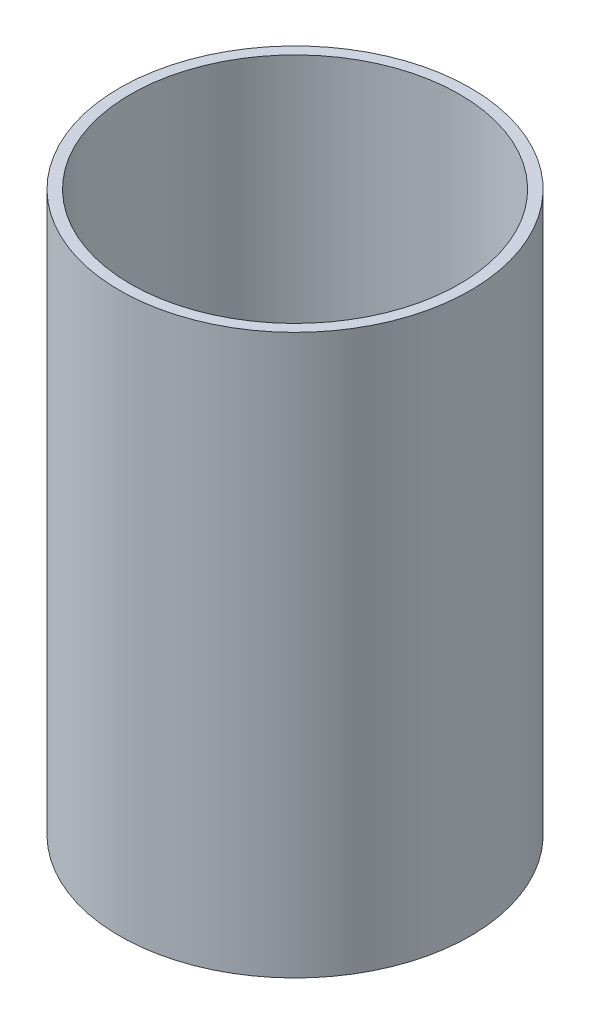
ISO-10303-21;
HEADER;
FILE_DESCRIPTION(('STEP AP214'),'2;1');
FILE_NAME('part.step','',(''),(''),'','','');
FILE_SCHEMA(('AUTOMOTIVE_DESIGN { 1 0 10303 214 1 1 1 1 }'));
ENDSEC;
DATA;
#1=APPLICATION_CONTEXT('core data for automotive mechanical design processes');
#2=APPLICATION_PROTOCOL_DEFINITION('international standard','automotive_design',2000,#1);
#3=PRODUCT_CONTEXT('',#1,'mechanical');
#4=PRODUCT('Part','Part','',(#3));
#5=PRODUCT_RELATED_PRODUCT_CATEGORY('part','',(#4));
#6=PRODUCT_DEFINITION_FORMATION('','',#4);
#7=PRODUCT_DEFINITION_CONTEXT('part definition',#1,'design');
#8=PRODUCT_DEFINITION('design','',#6,#7);
#9=PRODUCT_DEFINITION_SHAPE('','',#8);
#10=(LENGTH_UNIT() NAMED_UNIT(*) SI_UNIT(.MILLI.,.METRE.));
#11=(NAMED_UNIT(*) PLANE_ANGLE_UNIT() SI_UNIT($,.RADIAN.));
#12=(NAMED_UNIT(*) SI_UNIT($,.STERADIAN.) SOLID_ANGLE_UNIT());
#13=UNCERTAINTY_MEASURE_WITH_UNIT(LENGTH_MEASURE(1.E-05),#10,'distance_accuracy_value','');
#14=(GEOMETRIC_REPRESENTATION_CONTEXT(3) GLOBAL_UNCERTAINTY_ASSIGNED_CONTEXT((#13)) GLOBAL_UNIT_ASSIGNED_CONTEXT((#10,
#11,#12)) REPRESENTATION_CONTEXT('',''));
#15=CARTESIAN_POINT('',(0.,0.,0.));
#16=DIRECTION('',(0.,0.,1.));
#17=DIRECTION('',(1.,0.,0.));
#18=AXIS2_PLACEMENT_3D('',#15,#16,#17);
#19=CARTESIAN_POINT('',(0.,100.,0.));
#20=DIRECTION('',(0.,-1.,0.));
#21=DIRECTION('',(0.,0.,-1.));
#22=AXIS2_PLACEMENT_3D('',#19,#20,#21);
#23=CYLINDRICAL_SURFACE('',#22,32.);
#24=CARTESIAN_POINT('',(0.,100.,0.));
#25=DIRECTION('',(0.,1.,0.));
#26=DIRECTION('',(0.,0.,1.));
#27=AXIS2_PLACEMENT_3D('',#24,#25,#26);
#28=CIRCLE('',#27,32.);
#29=CARTESIAN_POINT('',(0.,100.,-32.));
#30=VERTEX_POINT('',#29);
#31=EDGE_CURVE('E10',#30,#30,#28,.T.);
#32=CARTESIAN_POINT('',(0.,-2.,0.));
#33=DIRECTION('',(0.,1.,0.));
#34=DIRECTION('',(0.,0.,1.));
#35=AXIS2_PLACEMENT_3D('',#32,#33,#34);
#36=CIRCLE('',#35,32.);
#37=CARTESIAN_POINT('',(0.,-2.,-32.));
#38=VERTEX_POINT('',#37);
#39=EDGE_CURVE('E37',#38,#38,#36,.T.);
#40=CARTESIAN_POINT('',(0.,100.,-32.));
#41=CARTESIAN_POINT('',(0.,98.9375,-32.));
#42=CARTESIAN_POINT('',(0.,97.875,-32.));
#43=CARTESIAN_POINT('',(0.,95.75,-32.));
#44=CARTESIAN_POINT('',(0.,94.6875,-32.));
#45=CARTESIAN_POINT('',(0.,92.5625,-32.));
#46=CARTESIAN_POINT('',(0.,91.5,-32.));
#47=CARTESIAN_POINT('',(0.,89.375,-32.));
#48=CARTESIAN_POINT('',(0.,88.3125,-32.));
#49=CARTESIAN_POINT('',(0.,86.1875,-32.));
#50=CARTESIAN_POINT('',(0.,85.125,-32.));
#51=CARTESIAN_POINT('',(0.,83.,-32.));
#52=CARTESIAN_POINT('',(0.,81.9375,-32.));
#53=CARTESIAN_POINT('',(0.,79.8125,-32.));
#54=CARTESIAN_POINT('',(0.,78.75,-32.));
#55=CARTESIAN_POINT('',(0.,76.625,-32.));
#56=CARTESIAN_POINT('',(0.,75.5625,-32.));
#57=CARTESIAN_POINT('',(0.,73.4375,-32.));
#58=CARTESIAN_POINT('',(0.,72.375,-32.));
#59=CARTESIAN_POINT('',(0.,70.25,-32.));
#60=CARTESIAN_POINT('',(0.,69.1875,-32.));
#61=CARTESIAN_POINT('',(0.,67.0625,-32.));
#62=CARTESIAN_POINT('',(0.,66.,-32.));
#63=CARTESIAN_POINT('',(0.,63.875,-32.));
#64=CARTESIAN_POINT('',(0.,62.8125,-32.));
#65=CARTESIAN_POINT('',(0.,60.6875,-32.));
#66=CARTESIAN_POINT('',(0.,59.625,-32.));
#67=CARTESIAN_POINT('',(0.,57.5,-32.));
#68=CARTESIAN_POINT('',(0.,56.4375,-32.));
#69=CARTESIAN_POINT('',(0.,54.3125,-32.));
#70=CARTESIAN_POINT('',(0.,53.25,-32.));
#71=CARTESIAN_POINT('',(0.,51.125,-32.));
#72=CARTESIAN_POINT('',(0.,50.0625,-32.));
#73=CARTESIAN_POINT('',(0.,47.9375,-32.));
#74=CARTESIAN_POINT('',(0.,46.875,-32.));
#75=CARTESIAN_POINT('',(0.,44.75,-32.));
#76=CARTESIAN_POINT('',(0.,43.6875,-32.));
#77=CARTESIAN_POINT('',(0.,41.5625,-32.));
#78=CARTESIAN_POINT('',(0.,40.5,-32.));
#79=CARTESIAN_POINT('',(0.,38.375,-32.));
#80=CARTESIAN_POINT('',(0.,37.3125,-32.));
#81=CARTESIAN_POINT('',(0.,35.1875,-32.));
#82=CARTESIAN_POINT('',(0.,34.125,-32.));
#83=CARTESIAN_POINT('',(0.,32.,-32.));
#84=CARTESIAN_POINT('',(0.,30.9375,-32.));
#85=CARTESIAN_POINT('',(0.,28.8125,-32.));
#86=CARTESIAN_POINT('',(0.,27.75,-32.));
#87=CARTESIAN_POINT('',(0.,25.625,-32.));
#88=CARTESIAN_POINT('',(0.,24.5625,-32.));
#89=CARTESIAN_POINT('',(0.,22.4375,-32.));
#90=CARTESIAN_POINT('',(0.,21.375,-32.));
#91=CARTESIAN_POINT('',(0.,19.25,-32.));
#92=CARTESIAN_POINT('',(0.,18.1875,-32.));
#93=CARTESIAN_POINT('',(0.,16.0625,-32.));
#94=CARTESIAN_POINT('',(0.,15.,-32.));
#95=CARTESIAN_POINT('',(0.,12.875,-32.));
#96=CARTESIAN_POINT('',(0.,11.8125,-32.));
#97=CARTESIAN_POINT('',(0.,9.6875,-32.));
#98=CARTESIAN_POINT('',(0.,8.625,-32.));
#99=CARTESIAN_POINT('',(0.,6.5,-32.));
#100=CARTESIAN_POINT('',(0.,5.4375,-32.));
#101=CARTESIAN_POINT('',(0.,3.3125,-32.));
#102=CARTESIAN_POINT('',(0.,2.25,-32.));
#103=CARTESIAN_POINT('',(0.,0.124999999999996,-32.));
#104=CARTESIAN_POINT('',(0.,-0.937500000000001,-32.));
#105=CARTESIAN_POINT('',(0.,-2.,-32.));
#106=B_SPLINE_CURVE_WITH_KNOTS('',3,(#40,#41,#42,#43,#44,#45,#46,#47,#48,#49,#50,#51,#52,#53,
#54,#55,#56,#57,#58,#59,#60,#61,#62,#63,#64,#65,#66,#67,#68,#69,#70,#71,#72,#73,#74,#75,#76,#77,
#78,#79,#80,#81,#82,#83,#84,#85,#86,#87,#88,#89,#90,#91,#92,#93,#94,#95,#96,#97,#98,#99,#100,
#101,#102,#103,#104,#105),.UNSPECIFIED.,.F.,.F.,(4,2,2,2,2,2,2,2,2,2,2,2,2,2,2,2,2,2,2,2,2,2,2,
2,2,2,2,2,2,2,2,2,4),(0.,3.1875,6.37499999999999,9.56249999999999,12.75,15.9375,19.125,22.3125,
25.5,28.6875,31.875,35.0625,38.25,41.4375,44.625,47.8125,51.,54.1875,57.375,60.5625,63.75,
66.9375,70.125,73.3125,76.5,79.6875,82.875,86.0625,89.25,92.4375,95.625,98.8125,102.),.UNSPECIFIED.);
#107=EDGE_CURVE('BSEAM30',#30,#38,#106,.T.);
#108=ORIENTED_EDGE('',*,*,#31,.F.);
#109=ORIENTED_EDGE('',*,*,#39,.T.);
#110=ORIENTED_EDGE('',*,*,#107,.T.);
#111=ORIENTED_EDGE('',*,*,#107,.F.);
#112=EDGE_LOOP('',(#108,#110,#109,#111));
#113=FACE_BOUND('',#112,.T.);
#114=ADVANCED_FACE('F30',(#113),#23,.T.);
#115=CARTESIAN_POINT('',(0.,100.,0.));
#116=DIRECTION('',(0.,1.,0.));
#117=DIRECTION('',(0.,0.,1.));
#118=AXIS2_PLACEMENT_3D('',#115,#116,#117);
#119=PLANE('',#118);
#120=CARTESIAN_POINT('',(0.,100.,0.));
#121=DIRECTION('',(0.,1.,0.));
#122=DIRECTION('',(0.,0.,1.));
#123=AXIS2_PLACEMENT_3D('',#120,#121,#122);
#124=CIRCLE('',#123,30.);
#125=CARTESIAN_POINT('',(0.,100.,-30.));
#126=VERTEX_POINT('',#125);
#127=EDGE_CURVE('E41',#126,#126,#124,.T.);
#128=ORIENTED_EDGE('',*,*,#127,.F.);
#129=EDGE_LOOP('',(#128));
#130=FACE_BOUND('',#129,.T.);
#131=ORIENTED_EDGE('',*,*,#31,.T.);
#132=EDGE_LOOP('',(#131));
#133=FACE_BOUND('',#132,.T.);
#134=ADVANCED_FACE('F62',(#130,#133),#119,.T.);
#135=CARTESIAN_POINT('',(0.,-2.,0.));
#136=DIRECTION('',(0.,1.,0.));
#137=DIRECTION('',(0.,0.,1.));
#138=AXIS2_PLACEMENT_3D('',#135,#136,#137);
#139=PLANE('',#138);
#140=ORIENTED_EDGE('',*,*,#39,.F.);
#141=EDGE_LOOP('',(#140));
#142=FACE_BOUND('',#141,.T.);
#143=ADVANCED_FACE('F32',(#142),#139,.F.);
#144=CARTESIAN_POINT('',(0.,100.,0.));
#145=DIRECTION('',(0.,-1.,0.));
#146=DIRECTION('',(0.,0.,-1.));
#147=AXIS2_PLACEMENT_3D('',#144,#145,#146);
#148=CYLINDRICAL_SURFACE('',#147,30.);
#149=CARTESIAN_POINT('',(0.,0.,0.));
#150=DIRECTION('',(0.,1.,0.));
#151=DIRECTION('',(0.,0.,1.));
#152=AXIS2_PLACEMENT_3D('',#149,#150,#151);
#153=CIRCLE('',#152,30.);
#154=CARTESIAN_POINT('',(0.,0.,-30.));
#155=VERTEX_POINT('',#154);
#156=EDGE_CURVE('E45',#155,#155,#153,.T.);
#157=CARTESIAN_POINT('',(0.,100.,-30.));
#158=CARTESIAN_POINT('',(0.,98.9583333333333,-30.));
#159=CARTESIAN_POINT('',(0.,97.9166666666667,-30.));
#160=CARTESIAN_POINT('',(0.,95.8333333333333,-30.));
#161=CARTESIAN_POINT('',(0.,94.7916666666666,-30.));
#162=CARTESIAN_POINT('',(0.,92.7083333333333,-30.));
#163=CARTESIAN_POINT('',(0.,91.6666666666666,-30.));
#164=CARTESIAN_POINT('',(0.,89.5833333333333,-30.));
#165=CARTESIAN_POINT('',(0.,88.5416666666667,-30.));
#166=CARTESIAN_POINT('',(0.,86.4583333333333,-30.));
#167=CARTESIAN_POINT('',(0.,85.4166666666667,-30.));
#168=CARTESIAN_POINT('',(0.,83.3333333333333,-30.));
#169=CARTESIAN_POINT('',(0.,82.2916666666667,-30.));
#170=CARTESIAN_POINT('',(0.,80.2083333333333,-30.));
#171=CARTESIAN_POINT('',(0.,79.1666666666666,-30.));
#172=CARTESIAN_POINT('',(0.,77.0833333333333,-30.));
#173=CARTESIAN_POINT('',(0.,76.0416666666666,-30.));
#174=CARTESIAN_POINT('',(0.,73.9583333333333,-30.));
#175=CARTESIAN_POINT('',(0.,72.9166666666667,-30.));
#176=CARTESIAN_POINT('',(0.,70.8333333333333,-30.));
#177=CARTESIAN_POINT('',(0.,69.7916666666667,-30.));
#178=CARTESIAN_POINT('',(0.,67.7083333333333,-30.));
#179=CARTESIAN_POINT('',(0.,66.6666666666667,-30.));
#180=CARTESIAN_POINT('',(0.,64.5833333333333,-30.));
#181=CARTESIAN_POINT('',(0.,63.5416666666667,-30.));
#182=CARTESIAN_POINT('',(0.,61.4583333333333,-30.));
#183=CARTESIAN_POINT('',(0.,60.4166666666667,-30.));
#184=CARTESIAN_POINT('',(0.,58.3333333333333,-30.));
#185=CARTESIAN_POINT('',(0.,57.2916666666667,-30.));
#186=CARTESIAN_POINT('',(0.,55.2083333333333,-30.));
#187=CARTESIAN_POINT('',(0.,54.1666666666667,-30.));
#188=CARTESIAN_POINT('',(0.,52.0833333333333,-30.));
#189=CARTESIAN_POINT('',(0.,51.0416666666667,-30.));
#190=CARTESIAN_POINT('',(0.,48.9583333333333,-30.));
#191=CARTESIAN_POINT('',(0.,47.9166666666667,-30.));
#192=CARTESIAN_POINT('',(0.,45.8333333333333,-30.));
#193=CARTESIAN_POINT('',(0.,44.7916666666667,-30.));
#194=CARTESIAN_POINT('',(0.,42.7083333333333,-30.));
#195=CARTESIAN_POINT('',(0.,41.6666666666667,-30.));
#196=CARTESIAN_POINT('',(0.,39.5833333333333,-30.));
#197=CARTESIAN_POINT('',(0.,38.5416666666667,-30.));
#198=CARTESIAN_POINT('',(0.,36.4583333333333,-30.));
#199=CARTESIAN_POINT('',(0.,35.4166666666667,-30.));
#200=CARTESIAN_POINT('',(0.,33.3333333333333,-30.));
#201=CARTESIAN_POINT('',(0.,32.2916666666667,-30.));
#202=CARTESIAN_POINT('',(0.,30.2083333333333,-30.));
#203=CARTESIAN_POINT('',(0.,29.1666666666667,-30.));
#204=CARTESIAN_POINT('',(0.,27.0833333333333,-30.));
#205=CARTESIAN_POINT('',(0.,26.0416666666667,-30.));
#206=CARTESIAN_POINT('',(0.,23.9583333333333,-30.));
#207=CARTESIAN_POINT('',(0.,22.9166666666667,-30.));
#208=CARTESIAN_POINT('',(0.,20.8333333333333,-30.));
#209=CARTESIAN_POINT('',(0.,19.7916666666667,-30.));
#210=CARTESIAN_POINT('',(0.,17.7083333333333,-30.));
#211=CARTESIAN_POINT('',(0.,16.6666666666667,-30.));
#212=CARTESIAN_POINT('',(0.,14.5833333333333,-30.));
#213=CARTESIAN_POINT('',(0.,13.5416666666667,-30.));
#214=CARTESIAN_POINT('',(0.,11.4583333333333,-30.));
#215=CARTESIAN_POINT('',(0.,10.4166666666667,-30.));
#216=CARTESIAN_POINT('',(0.,8.33333333333333,-30.));
#217=CARTESIAN_POINT('',(0.,7.29166666666667,-30.));
#218=CARTESIAN_POINT('',(0.,5.20833333333334,-30.));
#219=CARTESIAN_POINT('',(0.,4.16666666666667,-30.));
#220=CARTESIAN_POINT('',(0.,2.08333333333334,-30.));
#221=CARTESIAN_POINT('',(0.,1.04166666666667,-30.));
#222=CARTESIAN_POINT('',(0.,0.,-30.));
#223=B_SPLINE_CURVE_WITH_KNOTS('',3,(#157,#158,#159,#160,#161,#162,#163,#164,#165,#166,#167,
#168,#169,#170,#171,#172,#173,#174,#175,#176,#177,#178,#179,#180,#181,#182,#183,#184,#185,#186,
#187,#188,#189,#190,#191,#192,#193,#194,#195,#196,#197,#198,#199,#200,#201,#202,#203,#204,#205,
#206,#207,#208,#209,#210,#211,#212,#213,#214,#215,#216,#217,#218,#219,#220,#221,#222),
.UNSPECIFIED.,.F.,.F.,(4,2,2,2,2,2,2,2,2,2,2,2,2,2,2,2,2,2,2,2,2,2,2,2,2,2,2,2,2,2,2,2,4),(0.,
3.12499999999999,6.24999999999999,9.37499999999999,12.5,15.625,18.75,21.875,25.,28.125,31.25,
34.375,37.5,40.625,43.75,46.875,50.,53.125,56.25,59.375,62.5,65.625,68.75,71.875,75.,78.125,
81.25,84.375,87.5,90.625,93.75,96.875,100.),.UNSPECIFIED.);
#224=EDGE_CURVE('BSEAM53',#126,#155,#223,.T.);
#225=ORIENTED_EDGE('',*,*,#127,.T.);
#226=ORIENTED_EDGE('',*,*,#156,.F.);
#227=ORIENTED_EDGE('',*,*,#224,.T.);
#228=ORIENTED_EDGE('',*,*,#224,.F.);
#229=EDGE_LOOP('',(#225,#227,#226,#228));
#230=FACE_BOUND('',#229,.T.);
#231=ADVANCED_FACE('F53',(#230),#148,.F.);
#232=CARTESIAN_POINT('',(0.,0.,0.));
#233=DIRECTION('',(0.,1.,0.));
#234=DIRECTION('',(0.,0.,1.));
#235=AXIS2_PLACEMENT_3D('',#232,#233,#234);
#236=PLANE('',#235);
#237=ORIENTED_EDGE('',*,*,#156,.T.);
#238=EDGE_LOOP('',(#237));
#239=FACE_BOUND('',#238,.T.);
#240=ADVANCED_FACE('F51',(#239),#236,.T.);
#241=CLOSED_SHELL('',(#114,#134,#143,#231,#240));
#242=MANIFOLD_SOLID_BREP('B2',#241);
#243=ADVANCED_BREP_SHAPE_REPRESENTATION('',(#18,#242),#14);
#244=SHAPE_DEFINITION_REPRESENTATION(#9,#243);
ENDSEC;
END-ISO-10303-21;
